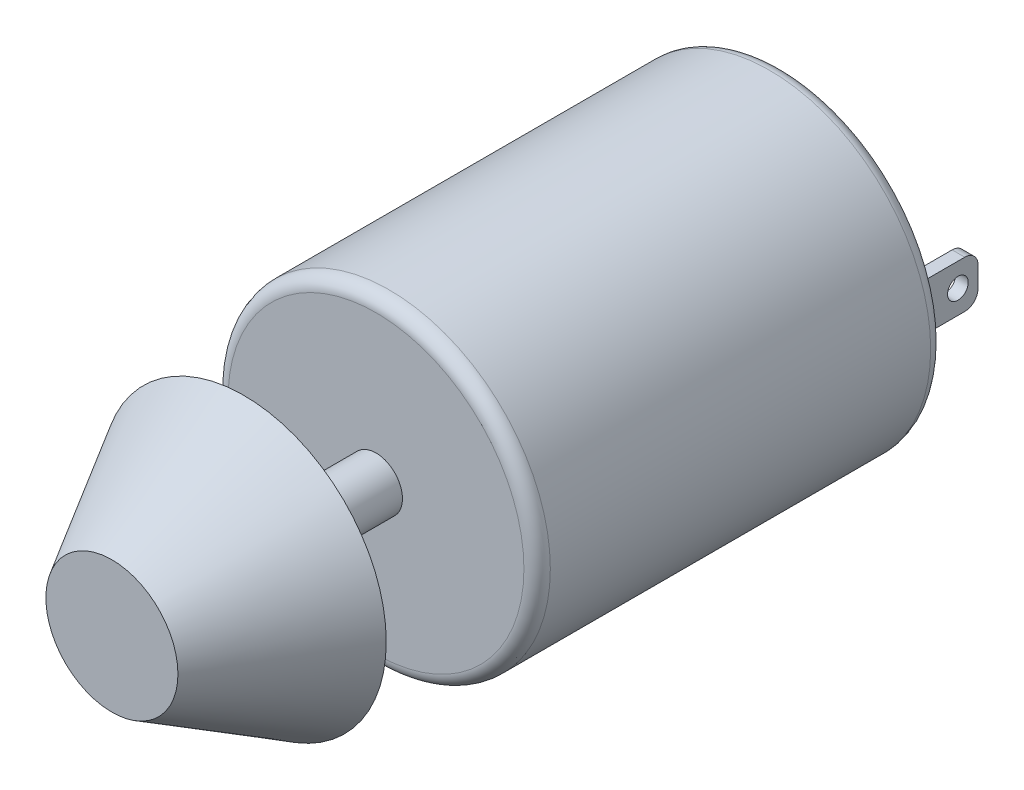
ISO-10303-21;
HEADER;
FILE_DESCRIPTION(('STEP AP214'),'2;1');
FILE_NAME('part.step','',(''),(''),'','','');
FILE_SCHEMA(('AUTOMOTIVE_DESIGN { 1 0 10303 214 1 1 1 1 }'));
ENDSEC;
DATA;
#1=APPLICATION_CONTEXT('core data for automotive mechanical design processes');
#2=APPLICATION_PROTOCOL_DEFINITION('international standard','automotive_design',2000,#1);
#3=PRODUCT_CONTEXT('',#1,'mechanical');
#4=PRODUCT('Part','Part','',(#3));
#5=PRODUCT_RELATED_PRODUCT_CATEGORY('part','',(#4));
#6=PRODUCT_DEFINITION_FORMATION('','',#4);
#7=PRODUCT_DEFINITION_CONTEXT('part definition',#1,'design');
#8=PRODUCT_DEFINITION('design','',#6,#7);
#9=PRODUCT_DEFINITION_SHAPE('','',#8);
#10=(LENGTH_UNIT() NAMED_UNIT(*) SI_UNIT(.MILLI.,.METRE.));
#11=(NAMED_UNIT(*) PLANE_ANGLE_UNIT() SI_UNIT($,.RADIAN.));
#12=(NAMED_UNIT(*) SI_UNIT($,.STERADIAN.) SOLID_ANGLE_UNIT());
#13=UNCERTAINTY_MEASURE_WITH_UNIT(LENGTH_MEASURE(1.E-05),#10,'distance_accuracy_value','');
#14=(GEOMETRIC_REPRESENTATION_CONTEXT(3) GLOBAL_UNCERTAINTY_ASSIGNED_CONTEXT((#13)) GLOBAL_UNIT_ASSIGNED_CONTEXT((#10,
#11,#12)) REPRESENTATION_CONTEXT('',''));
#15=CARTESIAN_POINT('',(0.,0.,0.));
#16=DIRECTION('',(0.,0.,1.));
#17=DIRECTION('',(1.,0.,0.));
#18=AXIS2_PLACEMENT_3D('',#15,#16,#17);
#19=CARTESIAN_POINT('',(0.,0.,0.));
#20=DIRECTION('',(0.,0.,1.));
#21=DIRECTION('',(1.,0.,0.));
#22=AXIS2_PLACEMENT_3D('',#19,#20,#21);
#23=PLANE('',#22);
#24=DIRECTION('',(0.,-1.,0.));
#25=VECTOR('',#24,1.);
#26=CARTESIAN_POINT('',(9.78281553796734,2.33021416497081,0.));
#27=LINE('',#26,#25);
#28=CARTESIAN_POINT('',(9.78281553796734,2.33021416497081,0.));
#29=VERTEX_POINT('',#28);
#30=CARTESIAN_POINT('',(9.78281553796734,-1.23400517051664,0.));
#31=VERTEX_POINT('',#30);
#32=EDGE_CURVE('E161',#29,#31,#27,.T.);
#33=ORIENTED_EDGE('',*,*,#32,.F.);
#34=DIRECTION('',(1.,0.,0.));
#35=VECTOR('',#34,1.);
#36=CARTESIAN_POINT('',(9.78281553796734,2.33021416497081,0.));
#37=LINE('',#36,#35);
#38=CARTESIAN_POINT('',(8.82391201155741,2.33021416497081,0.));
#39=VERTEX_POINT('',#38);
#40=EDGE_CURVE('E166',#39,#29,#37,.T.);
#41=ORIENTED_EDGE('',*,*,#40,.F.);
#42=DIRECTION('',(0.,1.,0.));
#43=VECTOR('',#42,1.);
#44=CARTESIAN_POINT('',(8.82391201155741,2.33021416497081,0.));
#45=LINE('',#44,#43);
#46=CARTESIAN_POINT('',(8.82391201155741,-1.23400517051664,0.));
#47=VERTEX_POINT('',#46);
#48=EDGE_CURVE('E175',#47,#39,#45,.T.);
#49=ORIENTED_EDGE('',*,*,#48,.F.);
#50=DIRECTION('',(-1.,0.,0.));
#51=VECTOR('',#50,1.);
#52=CARTESIAN_POINT('',(9.78281553796734,-1.23400517051664,0.));
#53=LINE('',#52,#51);
#54=EDGE_CURVE('E172',#31,#47,#53,.T.);
#55=ORIENTED_EDGE('',*,*,#54,.F.);
#56=EDGE_LOOP('',(#33,#41,#49,#55));
#57=FACE_BOUND('',#56,.T.);
#58=CARTESIAN_POINT('',(0.,0.,0.));
#59=DIRECTION('',(0.,0.,1.));
#60=DIRECTION('',(1.,0.,0.));
#61=AXIS2_PLACEMENT_3D('',#58,#59,#60);
#62=CIRCLE('',#61,11.2);
#63=CARTESIAN_POINT('',(11.2,0.,0.));
#64=VERTEX_POINT('',#63);
#65=EDGE_CURVE('E199',#64,#64,#62,.F.);
#66=ORIENTED_EDGE('',*,*,#65,.T.);
#67=EDGE_LOOP('',(#66));
#68=FACE_BOUND('',#67,.T.);
#69=DIRECTION('',(0.,1.,0.));
#70=VECTOR('',#69,1.);
#71=CARTESIAN_POINT('',(-8.81697969084172,2.33021416497081,0.));
#72=LINE('',#71,#70);
#73=CARTESIAN_POINT('',(-8.81697969084172,-1.23400517051664,0.));
#74=VERTEX_POINT('',#73);
#75=CARTESIAN_POINT('',(-8.81697969084172,2.33021416497081,0.));
#76=VERTEX_POINT('',#75);
#77=EDGE_CURVE('E127',#74,#76,#72,.T.);
#78=ORIENTED_EDGE('',*,*,#77,.F.);
#79=DIRECTION('',(-1.,0.,0.));
#80=VECTOR('',#79,1.);
#81=CARTESIAN_POINT('',(-8.81697969084172,-1.23400517051664,0.));
#82=LINE('',#81,#80);
#83=CARTESIAN_POINT('',(-7.92257314699185,-1.23400517051664,0.));
#84=VERTEX_POINT('',#83);
#85=EDGE_CURVE('E140',#84,#74,#82,.T.);
#86=ORIENTED_EDGE('',*,*,#85,.F.);
#87=DIRECTION('',(0.,-1.,0.));
#88=VECTOR('',#87,1.);
#89=CARTESIAN_POINT('',(-7.92257314699185,2.33021416497081,0.));
#90=LINE('',#89,#88);
#91=CARTESIAN_POINT('',(-7.92257314699185,2.33021416497081,0.));
#92=VERTEX_POINT('',#91);
#93=EDGE_CURVE('E149',#92,#84,#90,.T.);
#94=ORIENTED_EDGE('',*,*,#93,.F.);
#95=DIRECTION('',(1.,0.,0.));
#96=VECTOR('',#95,1.);
#97=CARTESIAN_POINT('',(-8.81697969084172,2.33021416497081,0.));
#98=LINE('',#97,#96);
#99=EDGE_CURVE('E143',#76,#92,#98,.T.);
#100=ORIENTED_EDGE('',*,*,#99,.F.);
#101=EDGE_LOOP('',(#78,#86,#94,#100));
#102=FACE_BOUND('',#101,.T.);
#103=ADVANCED_FACE('F32',(#57,#68,#102),#23,.F.);
#104=CARTESIAN_POINT('',(0.,0.,30.8));
#105=DIRECTION('',(0.,0.,1.));
#106=DIRECTION('',(1.,0.,0.));
#107=AXIS2_PLACEMENT_3D('',#104,#105,#106);
#108=PLANE('',#107);
#109=CARTESIAN_POINT('',(0.,0.,30.8));
#110=DIRECTION('',(0.,0.,1.));
#111=DIRECTION('',(1.,0.,0.));
#112=AXIS2_PLACEMENT_3D('',#109,#110,#111);
#113=CIRCLE('',#112,11.2);
#114=CARTESIAN_POINT('',(11.2,0.,30.8));
#115=VERTEX_POINT('',#114);
#116=EDGE_CURVE('E202',#115,#115,#113,.T.);
#117=ORIENTED_EDGE('',*,*,#116,.T.);
#118=EDGE_LOOP('',(#117));
#119=FACE_BOUND('',#118,.T.);
#120=CARTESIAN_POINT('',(0.,0.,30.8));
#121=DIRECTION('',(0.,0.,1.));
#122=DIRECTION('',(1.,0.,0.));
#123=AXIS2_PLACEMENT_3D('',#120,#121,#122);
#124=CIRCLE('',#123,2.);
#125=CARTESIAN_POINT('',(2.,0.,30.8));
#126=VERTEX_POINT('',#125);
#127=EDGE_CURVE('E187',#126,#126,#124,.T.);
#128=ORIENTED_EDGE('',*,*,#127,.F.);
#129=EDGE_LOOP('',(#128));
#130=FACE_BOUND('',#129,.T.);
#131=ADVANCED_FACE('F282',(#119,#130),#108,.T.);
#132=CARTESIAN_POINT('',(0.,0.,30.8));
#133=DIRECTION('',(0.,0.,-1.));
#134=DIRECTION('',(-1.,0.,0.));
#135=AXIS2_PLACEMENT_3D('',#132,#133,#134);
#136=CYLINDRICAL_SURFACE('',#135,12.2);
#137=CARTESIAN_POINT('',(0.,0.,1.));
#138=DIRECTION('',(0.,0.,1.));
#139=DIRECTION('',(1.,0.,0.));
#140=AXIS2_PLACEMENT_3D('',#137,#138,#139);
#141=CIRCLE('',#140,12.2);
#142=CARTESIAN_POINT('',(12.2,0.,1.));
#143=VERTEX_POINT('',#142);
#144=EDGE_CURVE('E196',#143,#143,#141,.T.);
#145=ORIENTED_EDGE('',*,*,#144,.T.);
#146=EDGE_LOOP('',(#145));
#147=FACE_BOUND('',#146,.T.);
#148=CARTESIAN_POINT('',(0.,0.,29.8));
#149=DIRECTION('',(0.,0.,1.));
#150=DIRECTION('',(1.,0.,0.));
#151=AXIS2_PLACEMENT_3D('',#148,#149,#150);
#152=CIRCLE('',#151,12.2);
#153=CARTESIAN_POINT('',(12.2,0.,29.8));
#154=VERTEX_POINT('',#153);
#155=EDGE_CURVE('E191',#154,#154,#152,.F.);
#156=ORIENTED_EDGE('',*,*,#155,.T.);
#157=EDGE_LOOP('',(#156));
#158=FACE_BOUND('',#157,.T.);
#159=ADVANCED_FACE('F288',(#147,#158),#136,.T.);
#160=CARTESIAN_POINT('',(0.,0.,1.));
#161=DIRECTION('',(0.,0.,1.));
#162=DIRECTION('',(1.,0.,0.));
#163=AXIS2_PLACEMENT_3D('',#160,#161,#162);
#164=TOROIDAL_SURFACE('',#163,11.2,1.);
#165=ORIENTED_EDGE('',*,*,#65,.F.);
#166=EDGE_LOOP('',(#165));
#167=FACE_BOUND('',#166,.T.);
#168=ORIENTED_EDGE('',*,*,#144,.F.);
#169=EDGE_LOOP('',(#168));
#170=FACE_BOUND('',#169,.T.);
#171=ADVANCED_FACE('F297',(#167,#170),#164,.T.);
#172=CARTESIAN_POINT('',(0.,0.,29.8));
#173=DIRECTION('',(0.,0.,1.));
#174=DIRECTION('',(1.,0.,0.));
#175=AXIS2_PLACEMENT_3D('',#172,#173,#174);
#176=TOROIDAL_SURFACE('',#175,11.2,1.);
#177=ORIENTED_EDGE('',*,*,#155,.F.);
#178=EDGE_LOOP('',(#177));
#179=FACE_BOUND('',#178,.T.);
#180=ORIENTED_EDGE('',*,*,#116,.F.);
#181=EDGE_LOOP('',(#180));
#182=FACE_BOUND('',#181,.T.);
#183=ADVANCED_FACE('F301',(#179,#182),#176,.T.);
#184=CARTESIAN_POINT('',(0.,0.,40.8));
#185=DIRECTION('',(0.,0.,-1.));
#186=DIRECTION('',(-1.,0.,0.));
#187=AXIS2_PLACEMENT_3D('',#184,#185,#186);
#188=CYLINDRICAL_SURFACE('',#187,2.);
#189=CARTESIAN_POINT('',(0.,0.,40.8));
#190=DIRECTION('',(0.,0.,1.));
#191=DIRECTION('',(1.,0.,0.));
#192=AXIS2_PLACEMENT_3D('',#189,#190,#191);
#193=CIRCLE('',#192,2.);
#194=CARTESIAN_POINT('',(2.,0.,40.8));
#195=VERTEX_POINT('',#194);
#196=EDGE_CURVE('E188',#195,#195,#193,.T.);
#197=ORIENTED_EDGE('',*,*,#196,.F.);
#198=EDGE_LOOP('',(#197));
#199=FACE_BOUND('',#198,.T.);
#200=ORIENTED_EDGE('',*,*,#127,.T.);
#201=EDGE_LOOP('',(#200));
#202=FACE_BOUND('',#201,.T.);
#203=ADVANCED_FACE('F304',(#199,#202),#188,.T.);
#204=CARTESIAN_POINT('',(9.78281553796734,2.33021416497081,-5.));
#205=DIRECTION('',(-1.,0.,0.));
#206=DIRECTION('',(0.,0.,1.));
#207=AXIS2_PLACEMENT_3D('',#204,#205,#206);
#208=PLANE('',#207);
#209=CARTESIAN_POINT('',(9.78281553796734,0.548104497227087,-3.47716986038904));
#210=DIRECTION('',(1.,0.,0.));
#211=DIRECTION('',(0.,0.,-1.));
#212=AXIS2_PLACEMENT_3D('',#209,#210,#211);
#213=CIRCLE('',#212,0.782109667743725);
#214=CARTESIAN_POINT('',(9.78281553796734,0.548104497227087,-4.25927952813276));
#215=VERTEX_POINT('',#214);
#216=EDGE_CURVE('E237',#215,#215,#213,.T.);
#217=ORIENTED_EDGE('',*,*,#216,.F.);
#218=EDGE_LOOP('',(#217));
#219=FACE_BOUND('',#218,.T.);
#220=DIRECTION('',(0.,-1.,0.));
#221=VECTOR('',#220,1.);
#222=CARTESIAN_POINT('',(9.78281553796734,2.33021416497081,-5.));
#223=LINE('',#222,#221);
#224=CARTESIAN_POINT('',(9.78281553796734,1.33021416497081,-5.));
#225=VERTEX_POINT('',#224);
#226=CARTESIAN_POINT('',(9.78281553796734,-0.234005170516639,-5.));
#227=VERTEX_POINT('',#226);
#228=EDGE_CURVE('E162',#225,#227,#223,.T.);
#229=ORIENTED_EDGE('',*,*,#228,.F.);
#230=CARTESIAN_POINT('',(9.78281553796734,1.33021416497081,-4.));
#231=DIRECTION('',(-1.,0.,0.));
#232=DIRECTION('',(0.,0.,1.));
#233=AXIS2_PLACEMENT_3D('',#230,#231,#232);
#234=CIRCLE('',#233,1.);
#235=CARTESIAN_POINT('',(9.78281553796734,2.33021416497081,-4.));
#236=VERTEX_POINT('',#235);
#237=EDGE_CURVE('E230',#225,#236,#234,.F.);
#238=ORIENTED_EDGE('',*,*,#237,.T.);
#239=DIRECTION('',(0.,0.,1.));
#240=VECTOR('',#239,1.);
#241=CARTESIAN_POINT('',(9.78281553796734,2.33021416497081,-5.));
#242=LINE('',#241,#240);
#243=EDGE_CURVE('E169',#236,#29,#242,.T.);
#244=ORIENTED_EDGE('',*,*,#243,.T.);
#245=ORIENTED_EDGE('',*,*,#32,.T.);
#246=DIRECTION('',(0.,0.,1.));
#247=VECTOR('',#246,1.);
#248=CARTESIAN_POINT('',(9.78281553796734,-1.23400517051664,-5.));
#249=LINE('',#248,#247);
#250=CARTESIAN_POINT('',(9.78281553796734,-1.23400517051664,-4.));
#251=VERTEX_POINT('',#250);
#252=EDGE_CURVE('E185',#251,#31,#249,.T.);
#253=ORIENTED_EDGE('',*,*,#252,.F.);
#254=CARTESIAN_POINT('',(9.78281553796734,-0.234005170516639,-4.));
#255=DIRECTION('',(-1.,0.,0.));
#256=DIRECTION('',(0.,0.,1.));
#257=AXIS2_PLACEMENT_3D('',#254,#255,#256);
#258=CIRCLE('',#257,1.);
#259=EDGE_CURVE('E228',#251,#227,#258,.F.);
#260=ORIENTED_EDGE('',*,*,#259,.T.);
#261=EDGE_LOOP('',(#229,#238,#244,#245,#253,#260));
#262=FACE_BOUND('',#261,.T.);
#263=ADVANCED_FACE('F309',(#219,#262),#208,.F.);
#264=CARTESIAN_POINT('',(9.78281553796734,-1.23400517051664,-5.));
#265=DIRECTION('',(0.,1.,0.));
#266=DIRECTION('',(0.,0.,1.));
#267=AXIS2_PLACEMENT_3D('',#264,#265,#266);
#268=PLANE('',#267);
#269=DIRECTION('',(0.,0.,1.));
#270=VECTOR('',#269,1.);
#271=CARTESIAN_POINT('',(8.82391201155741,-1.23400517051664,-5.));
#272=LINE('',#271,#270);
#273=CARTESIAN_POINT('',(8.82391201155741,-1.23400517051664,-4.));
#274=VERTEX_POINT('',#273);
#275=EDGE_CURVE('E183',#274,#47,#272,.T.);
#276=ORIENTED_EDGE('',*,*,#275,.F.);
#277=DIRECTION('',(-1.,0.,0.));
#278=VECTOR('',#277,1.);
#279=CARTESIAN_POINT('',(9.78281553796734,-1.23400517051664,-4.));
#280=LINE('',#279,#278);
#281=EDGE_CURVE('E11',#274,#251,#280,.F.);
#282=ORIENTED_EDGE('',*,*,#281,.T.);
#283=ORIENTED_EDGE('',*,*,#252,.T.);
#284=ORIENTED_EDGE('',*,*,#54,.T.);
#285=EDGE_LOOP('',(#276,#282,#283,#284));
#286=FACE_BOUND('',#285,.T.);
#287=ADVANCED_FACE('F321',(#286),#268,.F.);
#288=CARTESIAN_POINT('',(8.82391201155741,2.33021416497081,-5.));
#289=DIRECTION('',(1.,0.,0.));
#290=DIRECTION('',(0.,0.,-1.));
#291=AXIS2_PLACEMENT_3D('',#288,#289,#290);
#292=PLANE('',#291);
#293=CARTESIAN_POINT('',(8.82391201155741,0.548104497227087,-3.47716986038904));
#294=DIRECTION('',(1.,0.,0.));
#295=DIRECTION('',(0.,0.,-1.));
#296=AXIS2_PLACEMENT_3D('',#293,#294,#295);
#297=CIRCLE('',#296,0.782109667743725);
#298=CARTESIAN_POINT('',(8.82391201155741,0.548104497227087,-4.25927952813276));
#299=VERTEX_POINT('',#298);
#300=EDGE_CURVE('E144',#299,#299,#297,.T.);
#301=ORIENTED_EDGE('',*,*,#300,.T.);
#302=EDGE_LOOP('',(#301));
#303=FACE_BOUND('',#302,.T.);
#304=DIRECTION('',(0.,0.,1.));
#305=VECTOR('',#304,1.);
#306=CARTESIAN_POINT('',(8.82391201155741,2.33021416497081,-5.));
#307=LINE('',#306,#305);
#308=CARTESIAN_POINT('',(8.82391201155741,2.33021416497081,-4.));
#309=VERTEX_POINT('',#308);
#310=EDGE_CURVE('E181',#309,#39,#307,.T.);
#311=ORIENTED_EDGE('',*,*,#310,.F.);
#312=CARTESIAN_POINT('',(8.82391201155741,1.33021416497081,-4.));
#313=DIRECTION('',(1.,0.,0.));
#314=DIRECTION('',(0.,0.,-1.));
#315=AXIS2_PLACEMENT_3D('',#312,#313,#314);
#316=CIRCLE('',#315,1.);
#317=CARTESIAN_POINT('',(8.82391201155741,1.33021416497081,-5.));
#318=VERTEX_POINT('',#317);
#319=EDGE_CURVE('E41',#309,#318,#316,.F.);
#320=ORIENTED_EDGE('',*,*,#319,.T.);
#321=DIRECTION('',(0.,1.,0.));
#322=VECTOR('',#321,1.);
#323=CARTESIAN_POINT('',(8.82391201155741,2.33021416497081,-5.));
#324=LINE('',#323,#322);
#325=CARTESIAN_POINT('',(8.82391201155741,-0.234005170516639,-5.));
#326=VERTEX_POINT('',#325);
#327=EDGE_CURVE('E165',#326,#318,#324,.T.);
#328=ORIENTED_EDGE('',*,*,#327,.F.);
#329=CARTESIAN_POINT('',(8.82391201155741,-0.234005170516639,-4.));
#330=DIRECTION('',(1.,0.,0.));
#331=DIRECTION('',(0.,0.,-1.));
#332=AXIS2_PLACEMENT_3D('',#329,#330,#331);
#333=CIRCLE('',#332,1.);
#334=EDGE_CURVE('E49',#326,#274,#333,.F.);
#335=ORIENTED_EDGE('',*,*,#334,.T.);
#336=ORIENTED_EDGE('',*,*,#275,.T.);
#337=ORIENTED_EDGE('',*,*,#48,.T.);
#338=EDGE_LOOP('',(#311,#320,#328,#335,#336,#337));
#339=FACE_BOUND('',#338,.T.);
#340=ADVANCED_FACE('F328',(#303,#339),#292,.F.);
#341=CARTESIAN_POINT('',(9.78281553796734,2.33021416497081,-5.));
#342=DIRECTION('',(0.,-1.,0.));
#343=DIRECTION('',(0.,0.,-1.));
#344=AXIS2_PLACEMENT_3D('',#341,#342,#343);
#345=PLANE('',#344);
#346=ORIENTED_EDGE('',*,*,#243,.F.);
#347=DIRECTION('',(1.,0.,0.));
#348=VECTOR('',#347,1.);
#349=CARTESIAN_POINT('',(8.82391201155741,2.33021416497081,-4.));
#350=LINE('',#349,#348);
#351=EDGE_CURVE('E57',#236,#309,#350,.F.);
#352=ORIENTED_EDGE('',*,*,#351,.T.);
#353=ORIENTED_EDGE('',*,*,#310,.T.);
#354=ORIENTED_EDGE('',*,*,#40,.T.);
#355=EDGE_LOOP('',(#346,#352,#353,#354));
#356=FACE_BOUND('',#355,.T.);
#357=ADVANCED_FACE('F332',(#356),#345,.F.);
#358=CARTESIAN_POINT('',(9.78281553796734,-1.23400517051664,-5.));
#359=DIRECTION('',(0.,0.,-1.));
#360=DIRECTION('',(-1.,0.,0.));
#361=AXIS2_PLACEMENT_3D('',#358,#359,#360);
#362=PLANE('',#361);
#363=ORIENTED_EDGE('',*,*,#327,.T.);
#364=DIRECTION('',(1.,0.,0.));
#365=VECTOR('',#364,1.);
#366=CARTESIAN_POINT('',(9.78281553796734,1.33021416497081,-5.));
#367=LINE('',#366,#365);
#368=EDGE_CURVE('E225',#318,#225,#367,.T.);
#369=ORIENTED_EDGE('',*,*,#368,.T.);
#370=ORIENTED_EDGE('',*,*,#228,.T.);
#371=DIRECTION('',(-1.,0.,0.));
#372=VECTOR('',#371,1.);
#373=CARTESIAN_POINT('',(8.82391201155741,-0.234005170516639,-5.));
#374=LINE('',#373,#372);
#375=EDGE_CURVE('E222',#227,#326,#374,.T.);
#376=ORIENTED_EDGE('',*,*,#375,.T.);
#377=EDGE_LOOP('',(#363,#369,#370,#376));
#378=FACE_BOUND('',#377,.T.);
#379=ADVANCED_FACE('F336',(#378),#362,.T.);
#380=CARTESIAN_POINT('',(-8.81697969084172,2.33021416497081,-5.));
#381=DIRECTION('',(1.,0.,0.));
#382=DIRECTION('',(0.,0.,-1.));
#383=AXIS2_PLACEMENT_3D('',#380,#381,#382);
#384=PLANE('',#383);
#385=CARTESIAN_POINT('',(-8.81697969084172,0.548104497227087,-3.47716986038904));
#386=DIRECTION('',(1.,0.,0.));
#387=DIRECTION('',(0.,0.,-1.));
#388=AXIS2_PLACEMENT_3D('',#385,#386,#387);
#389=CIRCLE('',#388,0.782109667743725);
#390=CARTESIAN_POINT('',(-8.81697969084172,0.548104497227087,-4.25927952813276));
#391=VERTEX_POINT('',#390);
#392=EDGE_CURVE('E236',#391,#391,#389,.T.);
#393=ORIENTED_EDGE('',*,*,#392,.T.);
#394=EDGE_LOOP('',(#393));
#395=FACE_BOUND('',#394,.T.);
#396=DIRECTION('',(0.,0.,1.));
#397=VECTOR('',#396,1.);
#398=CARTESIAN_POINT('',(-8.81697969084172,2.33021416497081,-5.));
#399=LINE('',#398,#397);
#400=CARTESIAN_POINT('',(-8.81697969084172,2.33021416497081,-4.));
#401=VERTEX_POINT('',#400);
#402=EDGE_CURVE('E159',#401,#76,#399,.T.);
#403=ORIENTED_EDGE('',*,*,#402,.F.);
#404=CARTESIAN_POINT('',(-8.81697969084172,1.33021416497081,-4.));
#405=DIRECTION('',(1.,0.,0.));
#406=DIRECTION('',(0.,0.,-1.));
#407=AXIS2_PLACEMENT_3D('',#404,#405,#406);
#408=CIRCLE('',#407,1.);
#409=CARTESIAN_POINT('',(-8.81697969084172,1.33021416497081,-5.));
#410=VERTEX_POINT('',#409);
#411=EDGE_CURVE('E218',#401,#410,#408,.F.);
#412=ORIENTED_EDGE('',*,*,#411,.T.);
#413=DIRECTION('',(0.,1.,0.));
#414=VECTOR('',#413,1.);
#415=CARTESIAN_POINT('',(-8.81697969084172,2.33021416497081,-5.));
#416=LINE('',#415,#414);
#417=CARTESIAN_POINT('',(-8.81697969084172,-0.234005170516639,-5.));
#418=VERTEX_POINT('',#417);
#419=EDGE_CURVE('E148',#418,#410,#416,.T.);
#420=ORIENTED_EDGE('',*,*,#419,.F.);
#421=CARTESIAN_POINT('',(-8.81697969084172,-0.234005170516639,-4.));
#422=DIRECTION('',(1.,0.,0.));
#423=DIRECTION('',(0.,0.,-1.));
#424=AXIS2_PLACEMENT_3D('',#421,#422,#423);
#425=CIRCLE('',#424,1.);
#426=CARTESIAN_POINT('',(-8.81697969084172,-1.23400517051664,-4.));
#427=VERTEX_POINT('',#426);
#428=EDGE_CURVE('E129',#418,#427,#425,.F.);
#429=ORIENTED_EDGE('',*,*,#428,.T.);
#430=DIRECTION('',(0.,0.,1.));
#431=VECTOR('',#430,1.);
#432=CARTESIAN_POINT('',(-8.81697969084172,-1.23400517051664,-5.));
#433=LINE('',#432,#431);
#434=EDGE_CURVE('E123',#427,#74,#433,.T.);
#435=ORIENTED_EDGE('',*,*,#434,.T.);
#436=ORIENTED_EDGE('',*,*,#77,.T.);
#437=EDGE_LOOP('',(#403,#412,#420,#429,#435,#436));
#438=FACE_BOUND('',#437,.T.);
#439=ADVANCED_FACE('F126',(#395,#438),#384,.F.);
#440=CARTESIAN_POINT('',(-8.81697969084172,2.33021416497081,-5.));
#441=DIRECTION('',(0.,-1.,0.));
#442=DIRECTION('',(0.,0.,-1.));
#443=AXIS2_PLACEMENT_3D('',#440,#441,#442);
#444=PLANE('',#443);
#445=DIRECTION('',(0.,0.,1.));
#446=VECTOR('',#445,1.);
#447=CARTESIAN_POINT('',(-7.92257314699185,2.33021416497081,-5.));
#448=LINE('',#447,#446);
#449=CARTESIAN_POINT('',(-7.92257314699185,2.33021416497081,-4.));
#450=VERTEX_POINT('',#449);
#451=EDGE_CURVE('E157',#450,#92,#448,.T.);
#452=ORIENTED_EDGE('',*,*,#451,.F.);
#453=DIRECTION('',(1.,0.,0.));
#454=VECTOR('',#453,1.);
#455=CARTESIAN_POINT('',(-8.81697969084172,2.33021416497081,-4.));
#456=LINE('',#455,#454);
#457=EDGE_CURVE('E215',#450,#401,#456,.F.);
#458=ORIENTED_EDGE('',*,*,#457,.T.);
#459=ORIENTED_EDGE('',*,*,#402,.T.);
#460=ORIENTED_EDGE('',*,*,#99,.T.);
#461=EDGE_LOOP('',(#452,#458,#459,#460));
#462=FACE_BOUND('',#461,.T.);
#463=ADVANCED_FACE('F255',(#462),#444,.F.);
#464=CARTESIAN_POINT('',(-7.92257314699185,2.33021416497081,-5.));
#465=DIRECTION('',(-1.,0.,0.));
#466=DIRECTION('',(0.,0.,1.));
#467=AXIS2_PLACEMENT_3D('',#464,#465,#466);
#468=PLANE('',#467);
#469=CARTESIAN_POINT('',(-7.92257314699185,0.548104497227087,-3.47716986038904));
#470=DIRECTION('',(-1.,0.,0.));
#471=DIRECTION('',(0.,0.,1.));
#472=AXIS2_PLACEMENT_3D('',#469,#470,#471);
#473=CIRCLE('',#472,0.782109667743725);
#474=CARTESIAN_POINT('',(-7.92257314699185,0.548104497227087,-2.69506019264532));
#475=VERTEX_POINT('',#474);
#476=EDGE_CURVE('E234',#475,#475,#473,.T.);
#477=ORIENTED_EDGE('',*,*,#476,.T.);
#478=EDGE_LOOP('',(#477));
#479=FACE_BOUND('',#478,.T.);
#480=DIRECTION('',(0.,-1.,0.));
#481=VECTOR('',#480,1.);
#482=CARTESIAN_POINT('',(-7.92257314699185,2.33021416497081,-5.));
#483=LINE('',#482,#481);
#484=CARTESIAN_POINT('',(-7.92257314699185,1.33021416497081,-5.));
#485=VERTEX_POINT('',#484);
#486=CARTESIAN_POINT('',(-7.92257314699185,-0.234005170516639,-5.));
#487=VERTEX_POINT('',#486);
#488=EDGE_CURVE('E134',#485,#487,#483,.T.);
#489=ORIENTED_EDGE('',*,*,#488,.F.);
#490=CARTESIAN_POINT('',(-7.92257314699185,1.33021416497081,-4.));
#491=DIRECTION('',(-1.,0.,0.));
#492=DIRECTION('',(0.,0.,1.));
#493=AXIS2_PLACEMENT_3D('',#490,#491,#492);
#494=CIRCLE('',#493,1.);
#495=EDGE_CURVE('E213',#485,#450,#494,.F.);
#496=ORIENTED_EDGE('',*,*,#495,.T.);
#497=ORIENTED_EDGE('',*,*,#451,.T.);
#498=ORIENTED_EDGE('',*,*,#93,.T.);
#499=DIRECTION('',(0.,0.,1.));
#500=VECTOR('',#499,1.);
#501=CARTESIAN_POINT('',(-7.92257314699185,-1.23400517051664,-5.));
#502=LINE('',#501,#500);
#503=CARTESIAN_POINT('',(-7.92257314699185,-1.23400517051664,-4.));
#504=VERTEX_POINT('',#503);
#505=EDGE_CURVE('E133',#504,#84,#502,.T.);
#506=ORIENTED_EDGE('',*,*,#505,.F.);
#507=CARTESIAN_POINT('',(-7.92257314699185,-0.234005170516639,-4.));
#508=DIRECTION('',(-1.,0.,0.));
#509=DIRECTION('',(0.,0.,1.));
#510=AXIS2_PLACEMENT_3D('',#507,#508,#509);
#511=CIRCLE('',#510,1.);
#512=EDGE_CURVE('E211',#504,#487,#511,.F.);
#513=ORIENTED_EDGE('',*,*,#512,.T.);
#514=EDGE_LOOP('',(#489,#496,#497,#498,#506,#513));
#515=FACE_BOUND('',#514,.T.);
#516=ADVANCED_FACE('F266',(#479,#515),#468,.F.);
#517=CARTESIAN_POINT('',(-8.81697969084172,-1.23400517051664,-5.));
#518=DIRECTION('',(0.,1.,0.));
#519=DIRECTION('',(0.,0.,1.));
#520=AXIS2_PLACEMENT_3D('',#517,#518,#519);
#521=PLANE('',#520);
#522=ORIENTED_EDGE('',*,*,#434,.F.);
#523=DIRECTION('',(-1.,0.,0.));
#524=VECTOR('',#523,1.);
#525=CARTESIAN_POINT('',(-8.81697969084172,-1.23400517051664,-4.));
#526=LINE('',#525,#524);
#527=EDGE_CURVE('E220',#427,#504,#526,.F.);
#528=ORIENTED_EDGE('',*,*,#527,.T.);
#529=ORIENTED_EDGE('',*,*,#505,.T.);
#530=ORIENTED_EDGE('',*,*,#85,.T.);
#531=EDGE_LOOP('',(#522,#528,#529,#530));
#532=FACE_BOUND('',#531,.T.);
#533=ADVANCED_FACE('F146',(#532),#521,.F.);
#534=CARTESIAN_POINT('',(-8.81697969084172,-1.23400517051664,-5.));
#535=DIRECTION('',(0.,0.,1.));
#536=DIRECTION('',(1.,0.,0.));
#537=AXIS2_PLACEMENT_3D('',#534,#535,#536);
#538=PLANE('',#537);
#539=ORIENTED_EDGE('',*,*,#419,.T.);
#540=DIRECTION('',(1.,0.,0.));
#541=VECTOR('',#540,1.);
#542=CARTESIAN_POINT('',(-8.81697969084172,1.33021416497081,-5.));
#543=LINE('',#542,#541);
#544=EDGE_CURVE('E208',#410,#485,#543,.T.);
#545=ORIENTED_EDGE('',*,*,#544,.T.);
#546=ORIENTED_EDGE('',*,*,#488,.T.);
#547=DIRECTION('',(-1.,0.,0.));
#548=VECTOR('',#547,1.);
#549=CARTESIAN_POINT('',(-8.81697969084172,-0.234005170516639,-5.));
#550=LINE('',#549,#548);
#551=EDGE_CURVE('E205',#487,#418,#550,.T.);
#552=ORIENTED_EDGE('',*,*,#551,.T.);
#553=EDGE_LOOP('',(#539,#545,#546,#552));
#554=FACE_BOUND('',#553,.T.);
#555=ADVANCED_FACE('F263',(#554),#538,.F.);
#556=CARTESIAN_POINT('',(-8.81697969084172,1.33021416497081,-4.));
#557=DIRECTION('',(1.,0.,0.));
#558=DIRECTION('',(0.,0.,-1.));
#559=AXIS2_PLACEMENT_3D('',#556,#557,#558);
#560=CYLINDRICAL_SURFACE('',#559,1.);
#561=ORIENTED_EDGE('',*,*,#411,.F.);
#562=ORIENTED_EDGE('',*,*,#457,.F.);
#563=ORIENTED_EDGE('',*,*,#495,.F.);
#564=ORIENTED_EDGE('',*,*,#544,.F.);
#565=EDGE_LOOP('',(#561,#562,#563,#564));
#566=FACE_BOUND('',#565,.T.);
#567=ADVANCED_FACE('F260',(#566),#560,.T.);
#568=CARTESIAN_POINT('',(-8.81697969084172,-0.234005170516639,-4.));
#569=DIRECTION('',(-1.,0.,0.));
#570=DIRECTION('',(0.,0.,1.));
#571=AXIS2_PLACEMENT_3D('',#568,#569,#570);
#572=CYLINDRICAL_SURFACE('',#571,1.);
#573=ORIENTED_EDGE('',*,*,#512,.F.);
#574=ORIENTED_EDGE('',*,*,#527,.F.);
#575=ORIENTED_EDGE('',*,*,#428,.F.);
#576=ORIENTED_EDGE('',*,*,#551,.F.);
#577=EDGE_LOOP('',(#573,#574,#575,#576));
#578=FACE_BOUND('',#577,.T.);
#579=ADVANCED_FACE('F269',(#578),#572,.T.);
#580=CARTESIAN_POINT('',(9.78281553796734,1.33021416497081,-4.));
#581=DIRECTION('',(-1.,0.,0.));
#582=DIRECTION('',(0.,0.,1.));
#583=AXIS2_PLACEMENT_3D('',#580,#581,#582);
#584=CYLINDRICAL_SURFACE('',#583,1.);
#585=ORIENTED_EDGE('',*,*,#319,.F.);
#586=ORIENTED_EDGE('',*,*,#351,.F.);
#587=ORIENTED_EDGE('',*,*,#237,.F.);
#588=ORIENTED_EDGE('',*,*,#368,.F.);
#589=EDGE_LOOP('',(#585,#586,#587,#588));
#590=FACE_BOUND('',#589,.T.);
#591=ADVANCED_FACE('F271',(#590),#584,.T.);
#592=CARTESIAN_POINT('',(9.78281553796734,-0.234005170516639,-4.));
#593=DIRECTION('',(1.,0.,0.));
#594=DIRECTION('',(0.,0.,-1.));
#595=AXIS2_PLACEMENT_3D('',#592,#593,#594);
#596=CYLINDRICAL_SURFACE('',#595,1.);
#597=ORIENTED_EDGE('',*,*,#259,.F.);
#598=ORIENTED_EDGE('',*,*,#281,.F.);
#599=ORIENTED_EDGE('',*,*,#334,.F.);
#600=ORIENTED_EDGE('',*,*,#375,.F.);
#601=EDGE_LOOP('',(#597,#598,#599,#600));
#602=FACE_BOUND('',#601,.T.);
#603=ADVANCED_FACE('F277',(#602),#596,.T.);
#604=CARTESIAN_POINT('',(-12.2,0.548104497227087,-3.47716986038904));
#605=DIRECTION('',(1.,0.,0.));
#606=DIRECTION('',(0.,0.,-1.));
#607=AXIS2_PLACEMENT_3D('',#604,#605,#606);
#608=CYLINDRICAL_SURFACE('',#607,0.782109667743725);
#609=ORIENTED_EDGE('',*,*,#476,.F.);
#610=EDGE_LOOP('',(#609));
#611=FACE_BOUND('',#610,.T.);
#612=ORIENTED_EDGE('',*,*,#392,.F.);
#613=EDGE_LOOP('',(#612));
#614=FACE_BOUND('',#613,.T.);
#615=ADVANCED_FACE('F355',(#611,#614),#608,.F.);
#616=ORIENTED_EDGE('',*,*,#216,.T.);
#617=EDGE_LOOP('',(#616));
#618=FACE_BOUND('',#617,.T.);
#619=ORIENTED_EDGE('',*,*,#300,.F.);
#620=EDGE_LOOP('',(#619));
#621=FACE_BOUND('',#620,.T.);
#622=ADVANCED_FACE('F351',(#618,#621),#608,.F.);
#623=CARTESIAN_POINT('',(0.,0.,40.8));
#624=DIRECTION('',(0.,0.,1.));
#625=DIRECTION('',(1.,0.,0.));
#626=AXIS2_PLACEMENT_3D('',#623,#624,#625);
#627=PLANE('',#626);
#628=CARTESIAN_POINT('',(0.,0.,40.8));
#629=DIRECTION('',(0.,0.,1.));
#630=DIRECTION('',(1.,0.,0.));
#631=AXIS2_PLACEMENT_3D('',#628,#629,#630);
#632=CIRCLE('',#631,10.7735026918963);
#633=CARTESIAN_POINT('',(10.7735026918963,0.,40.8));
#634=VERTEX_POINT('',#633);
#635=EDGE_CURVE('E36',#634,#634,#632,.T.);
#636=ORIENTED_EDGE('',*,*,#635,.F.);
#637=EDGE_LOOP('',(#636));
#638=FACE_BOUND('',#637,.T.);
#639=ORIENTED_EDGE('',*,*,#196,.T.);
#640=EDGE_LOOP('',(#639));
#641=FACE_BOUND('',#640,.T.);
#642=ADVANCED_FACE('F354',(#638,#641),#627,.F.);
#643=CARTESIAN_POINT('',(0.,0.,50.8));
#644=DIRECTION('',(0.,0.,-1.));
#645=DIRECTION('',(1.,0.,0.));
#646=AXIS2_PLACEMENT_3D('',#643,#644,#645);
#647=CONICAL_SURFACE('',#646,5.,0.5235987755983);
#648=CARTESIAN_POINT('',(0.,0.,50.8));
#649=DIRECTION('',(0.,0.,1.));
#650=DIRECTION('',(1.,0.,0.));
#651=AXIS2_PLACEMENT_3D('',#648,#649,#650);
#652=CIRCLE('',#651,5.);
#653=CARTESIAN_POINT('',(5.,0.,50.8));
#654=VERTEX_POINT('',#653);
#655=EDGE_CURVE('E243',#654,#654,#652,.T.);
#656=ORIENTED_EDGE('',*,*,#655,.F.);
#657=EDGE_LOOP('',(#656));
#658=FACE_BOUND('',#657,.T.);
#659=ORIENTED_EDGE('',*,*,#635,.T.);
#660=EDGE_LOOP('',(#659));
#661=FACE_BOUND('',#660,.T.);
#662=ADVANCED_FACE('F34',(#658,#661),#647,.T.);
#663=CARTESIAN_POINT('',(0.,0.,50.8));
#664=DIRECTION('',(0.,0.,1.));
#665=DIRECTION('',(1.,0.,0.));
#666=AXIS2_PLACEMENT_3D('',#663,#664,#665);
#667=PLANE('',#666);
#668=ORIENTED_EDGE('',*,*,#655,.T.);
#669=EDGE_LOOP('',(#668));
#670=FACE_BOUND('',#669,.T.);
#671=ADVANCED_FACE('F359',(#670),#667,.T.);
#672=CLOSED_SHELL('',(#103,#131,#159,#171,#183,#203,#263,#287,#340,#357,#379,#439,#463,#516,
#533,#555,#567,#579,#591,#603,#615,#622,#642,#662,#671));
#673=MANIFOLD_SOLID_BREP('B2',#672);
#674=ADVANCED_BREP_SHAPE_REPRESENTATION('',(#18,#673),#14);
#675=SHAPE_DEFINITION_REPRESENTATION(#9,#674);
ENDSEC;
END-ISO-10303-21;
